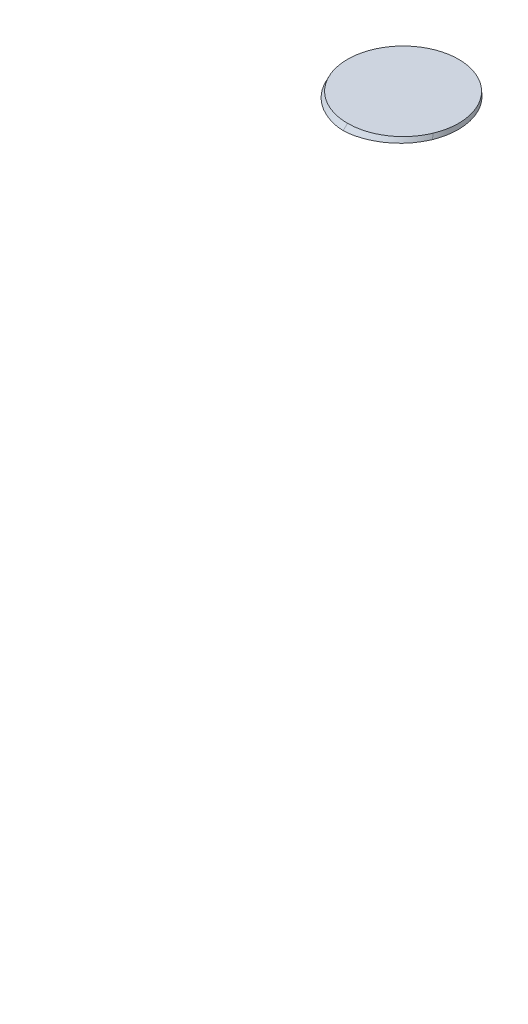
ISO-10303-21;
HEADER;
FILE_DESCRIPTION(('STEP AP214'),'2;1');
FILE_NAME('part.step','',(''),(''),'','','');
FILE_SCHEMA(('AUTOMOTIVE_DESIGN { 1 0 10303 214 1 1 1 1 }'));
ENDSEC;
DATA;
#1=APPLICATION_CONTEXT('core data for automotive mechanical design processes');
#2=APPLICATION_PROTOCOL_DEFINITION('international standard','automotive_design',2000,#1);
#3=PRODUCT_CONTEXT('',#1,'mechanical');
#4=PRODUCT('Part','Part','',(#3));
#5=PRODUCT_RELATED_PRODUCT_CATEGORY('part','',(#4));
#6=PRODUCT_DEFINITION_FORMATION('','',#4);
#7=PRODUCT_DEFINITION_CONTEXT('part definition',#1,'design');
#8=PRODUCT_DEFINITION('design','',#6,#7);
#9=PRODUCT_DEFINITION_SHAPE('','',#8);
#10=(LENGTH_UNIT() NAMED_UNIT(*) SI_UNIT(.MILLI.,.METRE.));
#11=(NAMED_UNIT(*) PLANE_ANGLE_UNIT() SI_UNIT($,.RADIAN.));
#12=(NAMED_UNIT(*) SI_UNIT($,.STERADIAN.) SOLID_ANGLE_UNIT());
#13=UNCERTAINTY_MEASURE_WITH_UNIT(LENGTH_MEASURE(1.E-05),#10,'distance_accuracy_value','');
#14=(GEOMETRIC_REPRESENTATION_CONTEXT(3) GLOBAL_UNCERTAINTY_ASSIGNED_CONTEXT((#13)) GLOBAL_UNIT_ASSIGNED_CONTEXT((#10,
#11,#12)) REPRESENTATION_CONTEXT('',''));
#15=CARTESIAN_POINT('',(0.,0.,0.));
#16=DIRECTION('',(0.,0.,1.));
#17=DIRECTION('',(1.,0.,0.));
#18=AXIS2_PLACEMENT_3D('',#15,#16,#17);
#19=CARTESIAN_POINT('',(0.,0.,37.8266622175129));
#20=CARTESIAN_POINT('',(0.,176.855656283399,16.5663637902874));
#21=CARTESIAN_POINT('',(0.,340.340668935007,-67.1145601095371));
#22=CARTESIAN_POINT('',(0.,461.01,-198.144465052552));
#23=CARTESIAN_POINT('',(16.2738372031163,0.,37.8339538467932));
#24=CARTESIAN_POINT('',(13.2830214298912,176.856067777989,16.5726593592351));
#25=CARTESIAN_POINT('',(9.72615474150384,340.341204936384,-67.1108402702335));
#26=CARTESIAN_POINT('',(4.26081652528172,461.01,-198.144465052552));
#27=CARTESIAN_POINT('',(48.6636929103227,0.,35.3809758118689));
#28=CARTESIAN_POINT('',(36.7186881567966,171.059242212549,0.164893382210145));
#29=CARTESIAN_POINT('',(24.7736834032705,332.090501701255,-81.8666581518978));
#30=CARTESIAN_POINT('',(12.8286786497444,461.01,-199.409945468399));
#31=CARTESIAN_POINT('',(95.786593648475,0.,23.4460334216123));
#32=CARTESIAN_POINT('',(72.0554768292909,165.2628281417,-24.0055233113302));
#33=CARTESIAN_POINT('',(48.3243600101067,323.840334467504,-102.667392780572));
#34=CARTESIAN_POINT('',(24.5932431909225,461.01,-205.003752771409));
#35=CARTESIAN_POINT('',(140.462615411223,0.,3.62505389254308));
#36=CARTESIAN_POINT('',(105.026484701463,159.46641407085,-54.4808815285309));
#37=CARTESIAN_POINT('',(69.5903539917018,315.590167233752,-128.191973317755));
#38=CARTESIAN_POINT('',(34.154223281941,461.01,-213.740310367776));
#39=CARTESIAN_POINT('',(167.938090833647,0.,-14.7174822626746));
#40=CARTESIAN_POINT('',(124.794467512548,155.602138023617,-78.7145845088735));
#41=CARTESIAN_POINT('',(81.6508441914497,310.090055744584,-147.913405544456));
#42=CARTESIAN_POINT('',(38.5072208703511,461.01,-221.057975000304));
#43=CARTESIAN_POINT('',(180.915270900199,0.,-25.1417994304734));
#44=CARTESIAN_POINT('',(133.979344147636,153.67,-91.7305614942916));
#45=CARTESIAN_POINT('',(87.0434173950731,307.34,-158.31932355811));
#46=CARTESIAN_POINT('',(40.1074906425099,461.01,-224.908085621928));
#47=B_SPLINE_SURFACE_WITH_KNOTS('',3,3,((#19,#20,#21,#22),(#23,#24,#25,#26),(#27,#28,#29,#30),
(#31,#32,#33,#34),(#35,#36,#37,#38),(#39,#40,#41,#42),(#43,#44,#45,#46)),.UNSPECIFIED.,.F.,.F.,
.F.,(4,1,1,1,4),(4,4),(0.,0.0454258486198599,0.0908516972397197,0.13627754585958,
0.181703394479439),(0.,1.),.UNSPECIFIED.);
#48=CARTESIAN_POINT('',(41.0772411952488,457.835,-223.532284752841));
#49=CARTESIAN_POINT('',(40.8243911024281,457.835,-222.922113494448));
#50=CARTESIAN_POINT('',(40.5585174426541,457.835,-222.31734768942));
#51=CARTESIAN_POINT('',(40.0013810367137,457.835,-221.11966021395));
#52=CARTESIAN_POINT('',(39.7101195100156,457.835,-220.526737976299));
#53=CARTESIAN_POINT('',(39.1028481265413,457.835,-219.353725818955));
#54=CARTESIAN_POINT('',(38.7868388494163,457.835,-218.773635599113));
#55=CARTESIAN_POINT('',(38.1306767928213,457.835,-217.627287056805));
#56=CARTESIAN_POINT('',(37.7905244154437,457.835,-217.06102850419));
#57=CARTESIAN_POINT('',(37.0884207633574,457.835,-215.946155059123));
#58=CARTESIAN_POINT('',(36.7265874122214,457.835,-215.397465902851));
#59=CARTESIAN_POINT('',(35.9801709110653,457.835,-214.315801302327));
#60=CARTESIAN_POINT('',(35.5955882296785,457.835,-213.782825534719));
#61=CARTESIAN_POINT('',(34.8041986364917,457.835,-212.733638246663));
#62=CARTESIAN_POINT('',(34.397391961663,457.835,-212.217426547555));
#63=CARTESIAN_POINT('',(33.5622484868052,457.835,-211.202731155373));
#64=CARTESIAN_POINT('',(33.1339113375796,457.835,-210.704247750053));
#65=CARTESIAN_POINT('',(32.1109721819335,457.835,-209.563258119222));
#66=CARTESIAN_POINT('',(31.5083849363508,457.835,-208.927883778328));
#67=CARTESIAN_POINT('',(30.2687065956873,457.835,-207.691736739446));
#68=CARTESIAN_POINT('',(29.6316143879102,457.835,-207.090965158597));
#69=CARTESIAN_POINT('',(28.3248998786488,457.835,-205.925902368785));
#70=CARTESIAN_POINT('',(27.655277730108,457.835,-205.361610988335));
#71=CARTESIAN_POINT('',(26.2835337837226,457.835,-204.269937125595));
#72=CARTESIAN_POINT('',(25.5813267939306,457.835,-203.742661636202));
#73=CARTESIAN_POINT('',(24.1481306072547,457.835,-202.728883355318));
#74=CARTESIAN_POINT('',(23.4171426399354,457.835,-202.242378824806));
#75=CARTESIAN_POINT('',(21.9293172711326,457.835,-201.310886839312));
#76=CARTESIAN_POINT('',(21.172483523385,457.835,-200.865893548937));
#77=CARTESIAN_POINT('',(19.8251840800042,457.835,-200.122500998338));
#78=CARTESIAN_POINT('',(19.2397091606116,457.835,-199.815009884807));
#79=CARTESIAN_POINT('',(18.0566982548129,457.835,-199.224090816232));
#80=CARTESIAN_POINT('',(17.4591617806366,457.835,-198.940663836767));
#81=CARTESIAN_POINT('',(16.253001565373,457.835,-198.398033777319));
#82=CARTESIAN_POINT('',(15.6443748700352,457.835,-198.138837268073));
#83=CARTESIAN_POINT('',(14.4169656652541,457.835,-197.644882429115));
#84=CARTESIAN_POINT('',(13.7981786383782,457.835,-197.410135330361));
#85=CARTESIAN_POINT('',(12.5542268915855,457.835,-196.966169365047));
#86=CARTESIAN_POINT('',(11.9290964429561,457.835,-196.756854537368));
#87=CARTESIAN_POINT('',(10.6707350906673,457.835,-196.364527889343));
#88=CARTESIAN_POINT('',(10.0375057666726,457.835,-196.181511022346));
#89=CARTESIAN_POINT('',(8.7638520981027,457.835,-195.844148621362));
#90=CARTESIAN_POINT('',(8.12343244197169,457.835,-195.689785438119));
#91=CARTESIAN_POINT('',(6.83620700331565,457.835,-195.412215867836));
#92=CARTESIAN_POINT('',(6.18940537223215,457.835,-195.288990456544));
#93=CARTESIAN_POINT('',(5.23479023622483,457.835,-195.132754808584));
#94=CARTESIAN_POINT('',(4.92909448554644,457.835,-195.086555610956));
#95=CARTESIAN_POINT('',(4.31665930396211,457.835,-195.001920548));
#96=CARTESIAN_POINT('',(4.0099200054725,457.835,-194.963483732507));
#97=CARTESIAN_POINT('',(3.39557247943344,457.835,-194.894666769313));
#98=CARTESIAN_POINT('',(3.0879643510748,457.835,-194.864285736728));
#99=CARTESIAN_POINT('',(2.47190876538906,457.835,-194.811851629702));
#100=CARTESIAN_POINT('',(2.16346101437874,457.835,-194.789801992883));
#101=CARTESIAN_POINT('',(1.54602837631372,457.835,-194.754323594595));
#102=CARTESIAN_POINT('',(1.237043427038,457.835,-194.740895909178));
#103=CARTESIAN_POINT('',(0.618708230361594,457.835,-194.722912389835));
#104=CARTESIAN_POINT('',(0.309357892887292,457.835,-194.718359666874));
#105=CARTESIAN_POINT('',(0.,457.835,-194.718372568102));
#106=B_SPLINE_CURVE_WITH_KNOTS('',3,(#48,#49,#50,#51,#52,#53,#54,#55,#56,#57,#58,#59,#60,#61,
#62,#63,#64,#65,#66,#67,#68,#69,#70,#71,#72,#73,#74,#75,#76,#77,#78,#79,#80,#81,#82,#83,#84,#85,
#86,#87,#88,#89,#90,#91,#92,#93,#94,#95,#96,#97,#98,#99,#100,#101,#102,#103,#104,#105),
.UNSPECIFIED.,.F.,.F.,(4,2,2,2,2,2,2,2,2,2,2,2,2,2,2,2,2,2,2,2,2,2,2,2,2,2,2,2,4),(0.,
1.98129706633792,3.96249901642415,5.9436545759057,7.92477714787358,9.89596068161459,
11.8671036233571,13.8382255511813,15.8093794583785,18.4349841472042,21.060673555498,
23.6863506199811,26.3193287118544,28.9521944409109,31.5846894984493,33.5681016598502,
35.551594191923,37.5356230499041,39.5205592986916,41.4977566819198,43.4745741273323,
45.4501698807338,47.4245556694453,48.3519768047285,49.2792843490371,50.2064899914566,
51.1340777918723,52.0617813361567,52.9898100124919),.UNSPECIFIED.);
#107=CARTESIAN_POINT('',(41.0772411952488,457.835,-223.532284752841));
#108=VERTEX_POINT('',#107);
#109=CARTESIAN_POINT('',(0.,457.834999999999,-194.718372568101));
#110=VERTEX_POINT('',#109);
#111=EDGE_CURVE('E114',#108,#110,#106,.T.);
#112=DIRECTION('',(-0.269855854661785,0.883518278109037,-0.382848886575369));
#113=VECTOR('',#112,1.);
#114=CARTESIAN_POINT('',(110.511380771355,230.505,-125.024942526201));
#115=LINE('',#114,#113);
#116=CARTESIAN_POINT('',(40.1074906425099,461.01,-224.908085621928));
#117=VERTEX_POINT('',#116);
#118=EDGE_CURVE('E172',#108,#117,#115,.T.);
#119=CARTESIAN_POINT('',(0.,461.01,-198.144465052552));
#120=CARTESIAN_POINT('',(4.26081652528172,461.01,-198.144465052552));
#121=CARTESIAN_POINT('',(12.8286786497444,461.01,-199.409945468399));
#122=CARTESIAN_POINT('',(24.5932431909225,461.01,-205.003752771409));
#123=CARTESIAN_POINT('',(34.154223281941,461.01,-213.740310367776));
#124=CARTESIAN_POINT('',(38.5072208703511,461.01,-221.057975000304));
#125=CARTESIAN_POINT('',(40.1074906425099,461.01,-224.908085621928));
#126=B_SPLINE_CURVE_WITH_KNOTS('',3,(#119,#120,#121,#122,#123,#124,#125),.UNSPECIFIED.,.F.,.F.,
(4,1,1,1,4),(0.,0.0454258486198599,0.0908516972397197,0.13627754585958,0.181703394479439),.UNSPECIFIED.);
#127=CARTESIAN_POINT('',(0.,461.01,-198.144465052552));
#128=VERTEX_POINT('',#127);
#129=EDGE_CURVE('E132',#128,#117,#126,.T.);
#130=CARTESIAN_POINT('',(0.,0.,37.8266622175129));
#131=CARTESIAN_POINT('',(0.,176.855656283399,16.5663637902874));
#132=CARTESIAN_POINT('',(0.,340.340668935007,-67.1145601095371));
#133=CARTESIAN_POINT('',(0.,461.01,-198.144465052552));
#134=B_SPLINE_CURVE_WITH_KNOTS('',3,(#130,#131,#132,#133),.UNSPECIFIED.,.F.,.F.,(4,4),(0.,1.),.UNSPECIFIED.);
#135=EDGE_CURVE('E121',#110,#128,#134,.T.);
#136=ORIENTED_EDGE('',*,*,#111,.F.);
#137=ORIENTED_EDGE('',*,*,#118,.T.);
#138=ORIENTED_EDGE('',*,*,#129,.F.);
#139=ORIENTED_EDGE('',*,*,#135,.F.);
#140=EDGE_LOOP('',(#136,#137,#138,#139));
#141=FACE_BOUND('',#140,.T.);
#142=ADVANCED_FACE('F80',(#141),#47,.T.);
#143=CARTESIAN_POINT('',(24.2259791158959,461.01,-205.527544486969));
#144=DIRECTION('',(0.,-1.,3.07059717205403E-13));
#145=DIRECTION('',(0.,-3.07059717205403E-13,-1.));
#146=AXIS2_PLACEMENT_3D('',#143,#144,#145);
#147=PLANE('',#146);
#148=ORIENTED_EDGE('',*,*,#129,.T.);
#149=CARTESIAN_POINT('',(40.1074906425099,461.01,-224.908085621928));
#150=CARTESIAN_POINT('',(41.8780040229971,461.01,-229.167787636261));
#151=CARTESIAN_POINT('',(44.0257828378412,461.009999999999,-238.188253767412));
#152=CARTESIAN_POINT('',(43.1036005743337,461.01,-249.612051547517));
#153=CARTESIAN_POINT('',(40.3137245671403,461.01,-258.204593498601));
#154=CARTESIAN_POINT('',(37.2632392750082,461.01,-264.23349338102));
#155=CARTESIAN_POINT('',(33.3226625075956,461.01,-269.70462823815));
#156=CARTESIAN_POINT('',(30.1712134255373,461.01,-272.902871411489));
#157=CARTESIAN_POINT('',(26.5089975315132,461.01,-276.083715254617));
#158=CARTESIAN_POINT('',(22.2673703077516,461.01,-279.140719558671));
#159=CARTESIAN_POINT('',(15.226146532433,461.010000000001,-282.505207352624));
#160=CARTESIAN_POINT('',(7.72365131381288,461.010000000001,-284.551933601713));
#161=CARTESIAN_POINT('',(-0.00935791936474599,461.01,-285.245026817753));
#162=CARTESIAN_POINT('',(-7.74212373835592,461.009999999999,-284.548615512557));
#163=CARTESIAN_POINT('',(-15.2438856512909,461.009999999999,-282.498616777706));
#164=CARTESIAN_POINT('',(-22.2838831662997,461.010000000001,-279.130947704782));
#165=CARTESIAN_POINT('',(-26.5243591779975,461.01,-276.07191894679));
#166=CARTESIAN_POINT('',(-30.1849426382904,461.01,-272.889612095302));
#167=CARTESIAN_POINT('',(-33.3343956896679,461.01,-269.690623293021));
#168=CARTESIAN_POINT('',(-37.2719856644906,461.01,-264.218963591208));
#169=CARTESIAN_POINT('',(-40.319653447414,461.01,-258.190055958844));
#170=CARTESIAN_POINT('',(-43.1060790369736,461.010000000001,-249.597995096214));
#171=CARTESIAN_POINT('',(-44.0246735499032,461.01,-238.175348771264));
#172=CARTESIAN_POINT('',(-41.8744261743165,461.01,-229.155605423159));
#173=CARTESIAN_POINT('',(-40.1025247862652,461.01,-224.896143218737));
#174=B_SPLINE_CURVE_WITH_KNOTS('',3,(#149,#150,#151,#152,#153,#154,#155,#156,#157,#158,#159,
#160,#161,#162,#163,#164,#165,#166,#167,#168,#169,#170,#171,#172,#173),.UNSPECIFIED.,.F.,.F.,(4,
1,1,1,1,1,2,1,1,1,1,1,1,1,2,1,1,1,1,1,4),(0.181703394479439,0.231961841016329,0.28222028755322,
0.307349510821665,0.33247873409011,0.357607957358555,0.382737180627,0.412076474912433,
0.441415769197866,0.470755063483299,0.500094357768732,0.529433652054165,0.558772946339598,
0.588112240625031,0.617451534910464,0.64257470662401,0.667697878337558,0.692821050051105,
0.717944221764651,0.768190565191745,0.818436908618839),.UNSPECIFIED.);
#175=CARTESIAN_POINT('',(-40.1025247862652,461.01,-224.896143218737));
#176=VERTEX_POINT('',#175);
#177=EDGE_CURVE('E142',#117,#176,#174,.T.);
#178=ORIENTED_EDGE('',*,*,#177,.T.);
#179=CARTESIAN_POINT('',(-40.1025247862652,461.01,-224.896143218737));
#180=CARTESIAN_POINT('',(-38.501851624576,461.01,-221.048295432272));
#181=CARTESIAN_POINT('',(-34.1483936162484,461.010000000002,-213.733340205379));
#182=CARTESIAN_POINT('',(-24.5860059797517,461.009999999998,-204.998900269145));
#183=CARTESIAN_POINT('',(-12.8215107168367,461.010000000001,-199.408083534367));
#184=CARTESIAN_POINT('',(-4.25752651654092,461.01,-198.144465052552));
#185=CARTESIAN_POINT('',(0.,461.01,-198.144465052552));
#186=B_SPLINE_CURVE_WITH_KNOTS('',3,(#179,#180,#181,#182,#183,#184,#185),.UNSPECIFIED.,.F.,.F.,
(4,1,1,1,4),(0.818436908618839,0.863827681464129,0.909218454309419,0.95460922715471,1.),.UNSPECIFIED.);
#187=EDGE_CURVE('E136',#176,#128,#186,.T.);
#188=ORIENTED_EDGE('',*,*,#187,.T.);
#189=EDGE_LOOP('',(#148,#178,#188));
#190=FACE_BOUND('',#189,.T.);
#191=ADVANCED_FACE('F184',(#190),#147,.F.);
#192=CARTESIAN_POINT('',(180.915270900199,0.,-25.1417994304734));
#193=CARTESIAN_POINT('',(133.979344147636,153.67,-91.7305614942916));
#194=CARTESIAN_POINT('',(87.0434173950731,307.34,-158.31932355811));
#195=CARTESIAN_POINT('',(40.1074906425099,461.01,-224.908085621928));
#196=CARTESIAN_POINT('',(182.764553739575,0.,-43.4647692189015));
#197=CARTESIAN_POINT('',(135.802370500716,153.67,-105.365775358021));
#198=CARTESIAN_POINT('',(88.8401872618566,307.34,-167.266781497141));
#199=CARTESIAN_POINT('',(41.8780040229971,461.01,-229.167787636261));
#200=CARTESIAN_POINT('',(182.934496924639,0.,-80.7365231107889));
#201=CARTESIAN_POINT('',(136.63159222904,153.67,-133.220433329663));
#202=CARTESIAN_POINT('',(90.3286875334404,307.34,-185.704343548538));
#203=CARTESIAN_POINT('',(44.0257828378412,461.009999999999,-238.188253767412));
#204=CARTESIAN_POINT('',(173.96381650555,0.,-126.992697283195));
#205=CARTESIAN_POINT('',(130.343744528478,153.67,-167.865815371303));
#206=CARTESIAN_POINT('',(86.7236725514057,307.34,-208.73893345941));
#207=CARTESIAN_POINT('',(43.1036005743337,461.01,-249.612051547517));
#208=CARTESIAN_POINT('',(161.356610836638,0.,-162.59980260165));
#209=CARTESIAN_POINT('',(121.008982080139,153.67,-194.468066233967));
#210=CARTESIAN_POINT('',(80.6613533236397,307.34,-226.336329866284));
#211=CARTESIAN_POINT('',(40.3137245671403,461.01,-258.204593498601));
#212=CARTESIAN_POINT('',(149.273172474338,0.,-188.312832378142));
#213=CARTESIAN_POINT('',(111.936528074562,153.67,-213.619719379101));
#214=CARTESIAN_POINT('',(74.5998836747849,307.34,-238.926606380061));
#215=CARTESIAN_POINT('',(37.2632392750082,461.01,-264.23349338102));
#216=CARTESIAN_POINT('',(134.665617032687,0.,-212.746278129332));
#217=CARTESIAN_POINT('',(100.88463219099,153.67,-231.732394832271));
#218=CARTESIAN_POINT('',(67.1036473492929,307.34,-250.718511535211));
#219=CARTESIAN_POINT('',(33.3226625075956,461.01,-269.70462823815));
#220=CARTESIAN_POINT('',(123.345757549626,0.,-228.001884615461));
#221=CARTESIAN_POINT('',(92.2875761749298,153.67,-242.968880214137));
#222=CARTESIAN_POINT('',(61.2293948002336,307.34,-257.935875812813));
#223=CARTESIAN_POINT('',(30.1712134255373,461.01,-272.902871411489));
#224=CARTESIAN_POINT('',(110.285132670713,0.,-243.884645412716));
#225=CARTESIAN_POINT('',(82.35975429098,153.67,-254.617668693349));
#226=CARTESIAN_POINT('',(54.4343759112466,307.34,-265.350691973983));
#227=CARTESIAN_POINT('',(26.5089975315132,461.01,-276.083715254617));
#228=CARTESIAN_POINT('',(94.2901878195833,0.,-259.504922954705));
#229=CARTESIAN_POINT('',(70.2825819823061,153.67,-266.050188489361));
#230=CARTESIAN_POINT('',(46.2749761450288,307.34,-272.595454024016));
#231=CARTESIAN_POINT('',(22.2673703077516,461.01,-279.140719558671));
#232=CARTESIAN_POINT('',(65.6190593842151,0.,-277.217367261442));
#233=CARTESIAN_POINT('',(48.8214217669544,153.67,-278.979980625169));
#234=CARTESIAN_POINT('',(32.0237841496937,307.34,-280.742593988896));
#235=CARTESIAN_POINT('',(15.226146532433,461.010000000001,-282.505207352624));
#236=CARTESIAN_POINT('',(33.6582002100138,0.,-288.25067540757));
#237=CARTESIAN_POINT('',(25.0133505779468,153.67,-287.017761472284));
#238=CARTESIAN_POINT('',(16.3685009458798,307.34,-285.784847536999));
#239=CARTESIAN_POINT('',(7.72365131381288,461.010000000001,-284.551933601713));
#240=CARTESIAN_POINT('',(-0.00184134112815246,0.,-291.997247453724));
#241=CARTESIAN_POINT('',(-0.00434686720701697,153.67,-289.746507241733));
#242=CARTESIAN_POINT('',(-0.00685239328588148,307.34,-287.495767029743));
#243=CARTESIAN_POINT('',(-0.00935791936474599,461.01,-285.245026817753));
#244=CARTESIAN_POINT('',(-33.661560363298,0.,-288.249883409989));
#245=CARTESIAN_POINT('',(-25.021748154984,153.67,-287.016127444178));
#246=CARTESIAN_POINT('',(-16.38193594667,307.34,-285.782371478367));
#247=CARTESIAN_POINT('',(-7.74212373835592,461.009999999999,-284.548615512557));
#248=CARTESIAN_POINT('',(-65.6215281171774,0.,-277.21612197542));
#249=CARTESIAN_POINT('',(-48.8289806285485,153.67,-278.976953576182));
#250=CARTESIAN_POINT('',(-32.0364331399197,307.34,-280.737785176944));
#251=CARTESIAN_POINT('',(-15.2438856512909,461.009999999999,-282.498616777706));
#252=CARTESIAN_POINT('',(-94.2914111238595,0.,-259.50384071545));
#253=CARTESIAN_POINT('',(-70.2889018046729,153.67,-266.046209711894));
#254=CARTESIAN_POINT('',(-46.2863924854863,307.34,-272.588578708338));
#255=CARTESIAN_POINT('',(-22.2838831662997,461.010000000001,-279.130947704782));
#256=CARTESIAN_POINT('',(-110.28550304737,0.,-243.884195005181));
#257=CARTESIAN_POINT('',(-82.3651217575793,153.67,-254.613436319051));
#258=CARTESIAN_POINT('',(-54.4447404677884,307.34,-265.342677632921));
#259=CARTESIAN_POINT('',(-26.5243591779975,461.01,-276.07191894679));
#260=CARTESIAN_POINT('',(-123.33470484305,0.,-227.996409980801));
#261=CARTESIAN_POINT('',(-92.2847841081302,153.67,-242.960810685635));
#262=CARTESIAN_POINT('',(-61.2348633732103,307.34,-257.925211390468));
#263=CARTESIAN_POINT('',(-30.1849426382904,461.01,-272.889612095302));
#264=CARTESIAN_POINT('',(-134.632233967405,0.,-212.730996948545));
#265=CARTESIAN_POINT('',(-100.866287874826,153.67,-231.71753906337));
#266=CARTESIAN_POINT('',(-67.1003417822469,307.34,-250.704081178196));
#267=CARTESIAN_POINT('',(-33.3343956896679,461.01,-269.690623293021));
#268=CARTESIAN_POINT('',(-149.205784351188,0.,-188.286535505023));
#269=CARTESIAN_POINT('',(-111.894518122289,153.67,-213.597344867084));
#270=CARTESIAN_POINT('',(-74.5832518933899,307.34,-238.908154229146));
#271=CARTESIAN_POINT('',(-37.2719856644906,461.01,-264.218963591208));
#272=CARTESIAN_POINT('',(-161.25496146668,0.,-162.566493639137));
#273=CARTESIAN_POINT('',(-120.943192126925,153.67,-194.441014412372));
#274=CARTESIAN_POINT('',(-80.6314227871695,307.34,-226.315535185608));
#275=CARTESIAN_POINT('',(-40.319653447414,461.01,-258.190055958844));
#276=CARTESIAN_POINT('',(-173.816711507298,0.,-126.955742814532));
#277=CARTESIAN_POINT('',(-130.246500683857,153.67,-167.836493575093));
#278=CARTESIAN_POINT('',(-86.6762898604151,307.34,-208.717244335653));
#279=CARTESIAN_POINT('',(-43.1060790369736,461.010000000001,-249.597995096214));
#280=CARTESIAN_POINT('',(-182.732185635456,0.,-80.7063813531382));
#281=CARTESIAN_POINT('',(-136.496348273605,153.67,-133.19603715918));
#282=CARTESIAN_POINT('',(-90.2605109117542,307.34,-185.685692965222));
#283=CARTESIAN_POINT('',(-44.0246735499032,461.01,-238.175348771264));
#284=CARTESIAN_POINT('',(-182.523439654924,0.,-43.4527769931953));
#285=CARTESIAN_POINT('',(-135.640435161388,153.67,-105.353719803183));
#286=CARTESIAN_POINT('',(-88.7574306678525,307.34,-167.254662613171));
#287=CARTESIAN_POINT('',(-41.8744261743165,461.01,-229.155605423159));
#288=CARTESIAN_POINT('',(-180.657164206162,0.,-25.1417994304731));
#289=CARTESIAN_POINT('',(-133.805617732863,153.67,-91.7265806932278));
#290=CARTESIAN_POINT('',(-86.9540712595643,307.34,-158.311361955982));
#291=CARTESIAN_POINT('',(-40.1025247862652,461.01,-224.896143218737));
#292=B_SPLINE_SURFACE_WITH_KNOTS('',3,3,((#192,#193,#194,#195),(#196,#197,#198,#199),(#200,#201,
#202,#203),(#204,#205,#206,#207),(#208,#209,#210,#211),(#212,#213,#214,#215),(#216,#217,#218,
#219),(#220,#221,#222,#223),(#224,#225,#226,#227),(#228,#229,#230,#231),(#232,#233,#234,#235),
(#236,#237,#238,#239),(#240,#241,#242,#243),(#244,#245,#246,#247),(#248,#249,#250,#251),(#252,
#253,#254,#255),(#256,#257,#258,#259),(#260,#261,#262,#263),(#264,#265,#266,#267),(#268,#269,
#270,#271),(#272,#273,#274,#275),(#276,#277,#278,#279),(#280,#281,#282,#283),(#284,#285,#286,
#287),(#288,#289,#290,#291)),.UNSPECIFIED.,.F.,.F.,.F.,(4,1,1,1,1,1,2,1,1,1,1,1,1,1,2,1,1,1,1,1,
4),(4,4),(0.181703394479439,0.231961841016329,0.28222028755322,0.307349510821665,
0.33247873409011,0.357607957358555,0.382737180627,0.412076474912433,0.441415769197866,
0.470755063483299,0.500094357768732,0.529433652054165,0.558772946339598,0.588112240625031,
0.617451534910464,0.64257470662401,0.667697878337558,0.692821050051105,0.717944221764651,
0.768190565191745,0.818436908618839),(0.,1.),.UNSPECIFIED.);
#293=CARTESIAN_POINT('',(-41.0705319448044,457.835,-223.520424597606));
#294=CARTESIAN_POINT('',(-41.3869568209653,457.835,-224.298054513311));
#295=CARTESIAN_POINT('',(-41.6813215056797,457.835,-225.084641656854));
#296=CARTESIAN_POINT('',(-42.2252991450807,457.835,-226.673139473737));
#297=CARTESIAN_POINT('',(-42.4749123018203,457.835,-227.475050077872));
#298=CARTESIAN_POINT('',(-42.9287604961273,457.835,-229.091618400597));
#299=CARTESIAN_POINT('',(-43.1329951158884,457.835,-229.906276236478));
#300=CARTESIAN_POINT('',(-43.4953637172038,457.835,-231.545147808259));
#301=CARTESIAN_POINT('',(-43.6535310944138,457.835,-232.369354169162));
#302=CARTESIAN_POINT('',(-43.9233894406798,457.835,-234.025369539729));
#303=CARTESIAN_POINT('',(-44.0350815931203,457.835,-234.857178355263));
#304=CARTESIAN_POINT('',(-44.1673296206268,457.835,-236.108517851855));
#305=CARTESIAN_POINT('',(-44.2055312275506,457.835,-236.526248281619));
#306=CARTESIAN_POINT('',(-44.2701013696751,457.835,-237.3626294576));
#307=CARTESIAN_POINT('',(-44.2964694200596,457.835,-237.781280240818));
#308=CARTESIAN_POINT('',(-44.3782984681353,457.835,-239.457376364093));
#309=CARTESIAN_POINT('',(-44.3864425180835,457.835,-240.717472365408));
#310=CARTESIAN_POINT('',(-44.2968768645322,457.835,-243.233854095554));
#311=CARTESIAN_POINT('',(-44.1991648365549,457.835,-244.490139740106));
#312=CARTESIAN_POINT('',(-43.9739199425003,457.835,-246.364678954973));
#313=CARTESIAN_POINT('',(-43.8857267585446,457.835,-246.987871061983));
#314=CARTESIAN_POINT('',(-43.683210959297,457.835,-248.230034658936));
#315=CARTESIAN_POINT('',(-43.5688883226535,457.835,-248.849006145429));
#316=CARTESIAN_POINT('',(-43.3142116475906,457.835,-250.08158605959));
#317=CARTESIAN_POINT('',(-43.1738566754709,457.835,-250.695194294068));
#318=CARTESIAN_POINT('',(-42.8672895223502,457.835,-251.915916817399));
#319=CARTESIAN_POINT('',(-42.701077311523,457.835,-252.523031098761));
#320=CARTESIAN_POINT('',(-42.3430622798222,457.835,-253.730277442284));
#321=CARTESIAN_POINT('',(-42.151236295636,457.835,-254.330402643558));
#322=CARTESIAN_POINT('',(-41.7425419339537,457.835,-255.522017987745));
#323=CARTESIAN_POINT('',(-41.5256735899339,457.835,-256.1135081422));
#324=CARTESIAN_POINT('',(-40.8382190425921,457.835,-257.87322305878));
#325=CARTESIAN_POINT('',(-40.3306199700175,457.835,-259.027242512506));
#326=CARTESIAN_POINT('',(-39.2204293777965,457.835,-261.288317259455));
#327=CARTESIAN_POINT('',(-38.6178495196059,457.835,-262.395378296944));
#328=CARTESIAN_POINT('',(-37.3204424721845,457.835,-264.555583548292));
#329=CARTESIAN_POINT('',(-36.6255228195703,457.835,-265.60867223343));
#330=CARTESIAN_POINT('',(-35.1494693251089,457.835,-267.652752122967));
#331=CARTESIAN_POINT('',(-34.3683357838324,457.835,-268.643743543839));
#332=CARTESIAN_POINT('',(-33.1363962672107,457.835,-270.078444700828));
#333=CARTESIAN_POINT('',(-32.7155564936448,457.835,-270.548198384211));
#334=CARTESIAN_POINT('',(-31.8544653552421,457.835,-271.469617414368));
#335=CARTESIAN_POINT('',(-31.4142140157575,457.835,-271.921282784764));
#336=CARTESIAN_POINT('',(-30.5150735802839,457.835,-272.805600121618));
#337=CARTESIAN_POINT('',(-30.0561859987152,457.835,-273.238253627096));
#338=CARTESIAN_POINT('',(-29.354459118491,457.835,-273.872362273257));
#339=CARTESIAN_POINT('',(-29.1183126624103,457.835,-274.081257294324));
#340=CARTESIAN_POINT('',(-28.6415827248757,457.835,-274.493928582378));
#341=CARTESIAN_POINT('',(-28.4009989517756,457.835,-274.697704510815));
#342=CARTESIAN_POINT('',(-27.1879019060955,457.835,-275.703017579336));
#343=CARTESIAN_POINT('',(-26.1825445451156,457.835,-276.465883292798));
#344=CARTESIAN_POINT('',(-24.6307530087644,457.835,-277.542110991223));
#345=CARTESIAN_POINT('',(-24.1070812308819,457.835,-277.889000608958));
#346=CARTESIAN_POINT('',(-23.0454584682878,457.835,-278.560135180749));
#347=CARTESIAN_POINT('',(-22.5075098131543,457.835,-278.884383798197));
#348=CARTESIAN_POINT('',(-21.4187736509424,457.835,-279.5093672074));
#349=CARTESIAN_POINT('',(-20.8679978743645,457.835,-279.81012246639));
#350=CARTESIAN_POINT('',(-19.7541144777705,457.835,-280.387921611379));
#351=CARTESIAN_POINT('',(-19.191006338857,457.835,-280.664964497237));
#352=CARTESIAN_POINT('',(-18.053282184502,457.835,-281.194875105161));
#353=CARTESIAN_POINT('',(-17.4786623198646,457.835,-281.447734572111));
#354=CARTESIAN_POINT('',(-16.3191093567829,457.835,-281.928627428196));
#355=CARTESIAN_POINT('',(-15.7341753174656,457.835,-282.156658538699));
#356=CARTESIAN_POINT('',(-13.9653213442135,457.835,-282.802813026617));
#357=CARTESIAN_POINT('',(-12.7672926294747,457.835,-283.183024082074));
#358=CARTESIAN_POINT('',(-10.3587489494182,457.835,-283.835967795594));
#359=CARTESIAN_POINT('',(-9.14858305328987,457.835,-284.109997855509));
#360=CARTESIAN_POINT('',(-6.70961371038914,457.835,-284.555674356511));
#361=CARTESIAN_POINT('',(-5.48081143901409,457.835,-284.727327227223));
#362=CARTESIAN_POINT('',(-3.0129221610269,457.835,-284.966771192018));
#363=CARTESIAN_POINT('',(-1.77383487184123,457.835,-285.034559422933));
#364=CARTESIAN_POINT('',(0.0854557169827443,457.835,-285.057237826268));
#365=CARTESIAN_POINT('',(0.705398809805119,457.835,-285.051624904428));
#366=CARTESIAN_POINT('',(1.94449529625227,457.835,-285.014142974262));
#367=CARTESIAN_POINT('',(2.5636486859051,457.835,-284.982273834394));
#368=CARTESIAN_POINT('',(4.41865737860438,457.835,-284.84752511138));
#369=CARTESIAN_POINT('',(5.65187008504397,457.835,-284.705501992601));
#370=CARTESIAN_POINT('',(8.10206058453671,457.835,-284.318508318158));
#371=CARTESIAN_POINT('',(9.31903806834946,457.835,-284.073535804447));
#372=CARTESIAN_POINT('',(11.12556362184,457.835,-283.630232788556));
#373=CARTESIAN_POINT('',(11.7246334838912,457.835,-283.46980709733));
#374=CARTESIAN_POINT('',(12.9155234504416,457.835,-283.123865391267));
#375=CARTESIAN_POINT('',(13.5073435817632,457.835,-282.938349469289));
#376=CARTESIAN_POINT('',(14.6825913066033,457.835,-282.542463431851));
#377=CARTESIAN_POINT('',(15.2660190484002,457.835,-282.332093756119));
#378=CARTESIAN_POINT('',(16.4234278419087,457.835,-281.886791147619));
#379=CARTESIAN_POINT('',(16.9974088730256,457.835,-281.651858161309));
#380=CARTESIAN_POINT('',(18.1353992381999,457.835,-281.157771088855));
#381=CARTESIAN_POINT('',(18.6994001266027,457.835,-280.898597555276));
#382=CARTESIAN_POINT('',(19.8159746256212,457.835,-280.356705107961));
#383=CARTESIAN_POINT('',(20.3685482351474,457.835,-280.07398619198));
#384=CARTESIAN_POINT('',(21.4613044012646,457.835,-279.485528188382));
#385=CARTESIAN_POINT('',(22.0014868607232,457.835,-279.179788920391));
#386=CARTESIAN_POINT('',(23.0684903534492,457.835,-278.545820373925));
#387=CARTESIAN_POINT('',(23.5953113626527,457.835,-278.217591054949));
#388=CARTESIAN_POINT('',(24.6347058697693,457.835,-277.539227149666));
#389=CARTESIAN_POINT('',(25.1472784197038,457.835,-277.189091110876));
#390=CARTESIAN_POINT('',(26.15722524601,457.835,-276.467552225922));
#391=CARTESIAN_POINT('',(26.6545996050995,457.835,-276.096149495538));
#392=CARTESIAN_POINT('',(27.6332505439754,457.835,-275.332703614287));
#393=CARTESIAN_POINT('',(28.1145271300148,457.835,-274.940660471439));
#394=CARTESIAN_POINT('',(29.0600620578904,457.835,-274.136568804617));
#395=CARTESIAN_POINT('',(29.5243203123058,457.835,-273.724520177903));
#396=CARTESIAN_POINT('',(30.4354380284813,457.835,-272.881361496536));
#397=CARTESIAN_POINT('',(30.8822928025651,457.835,-272.450246372139));
#398=CARTESIAN_POINT('',(31.7576895374614,457.835,-271.569887570575));
#399=CARTESIAN_POINT('',(32.1862315134694,457.835,-271.120643908453));
#400=CARTESIAN_POINT('',(33.4434445954202,457.835,-269.746819782953));
#401=CARTESIAN_POINT('',(34.2438878143583,457.835,-268.795974912746));
#402=CARTESIAN_POINT('',(35.3832421817698,457.835,-267.322882028894));
#403=CARTESIAN_POINT('',(35.7528543248375,457.835,-266.82397627879));
#404=CARTESIAN_POINT('',(36.4710947298093,457.835,-265.811215289875));
#405=CARTESIAN_POINT('',(36.8197230774775,457.835,-265.297360112178));
#406=CARTESIAN_POINT('',(37.4952483081195,457.835,-264.255579809684));
#407=CARTESIAN_POINT('',(37.8221453863721,457.835,-263.72765481138));
#408=CARTESIAN_POINT('',(38.4535964038899,457.835,-262.658604985938));
#409=CARTESIAN_POINT('',(38.7581502506828,457.835,-262.117480104181));
#410=CARTESIAN_POINT('',(39.3489694440695,457.835,-261.014720356462));
#411=CARTESIAN_POINT('',(39.6348866686281,457.835,-260.45289879377));
#412=CARTESIAN_POINT('',(40.1828231356309,457.835,-259.317765638404));
#413=CARTESIAN_POINT('',(40.4448422530124,457.835,-258.744453985621));
#414=CARTESIAN_POINT('',(41.1944184671358,457.835,-257.008767368332));
#415=CARTESIAN_POINT('',(41.6456111120755,457.835,-255.830422802899));
#416=CARTESIAN_POINT('',(42.4473383740423,457.835,-253.440027391977));
#417=CARTESIAN_POINT('',(42.7978627543639,457.835,-252.227973132367));
#418=CARTESIAN_POINT('',(43.3949495147253,457.835,-249.778386282094));
#419=CARTESIAN_POINT('',(43.6415142281176,457.835,-248.540854263928));
#420=CARTESIAN_POINT('',(43.9650491242646,457.835,-246.464471817578));
#421=CARTESIAN_POINT('',(44.0711522108949,457.835,-245.630029407978));
#422=CARTESIAN_POINT('',(44.2364343972971,457.835,-243.95642789223));
#423=CARTESIAN_POINT('',(44.2956119752133,457.835,-243.117268633998));
#424=CARTESIAN_POINT('',(44.3667805585958,457.835,-241.436916639155));
#425=CARTESIAN_POINT('',(44.3787688453722,457.835,-240.595723788178));
#426=CARTESIAN_POINT('',(44.3553429603122,457.835,-238.914442625625));
#427=CARTESIAN_POINT('',(44.3199545463901,457.835,-238.07435396222));
#428=CARTESIAN_POINT('',(44.2016263569406,457.835,-236.397613669084));
#429=CARTESIAN_POINT('',(44.1186905184003,457.835,-235.560961760561));
#430=CARTESIAN_POINT('',(43.9058443381054,457.835,-233.89386376261));
#431=CARTESIAN_POINT('',(43.7759474925503,457.835,-233.063415960091));
#432=CARTESIAN_POINT('',(43.5308115100364,457.835,-231.740549400807));
#433=CARTESIAN_POINT('',(43.4303690166327,457.835,-231.245338869902));
#434=CARTESIAN_POINT('',(43.2128538185096,457.835,-230.258673936923));
#435=CARTESIAN_POINT('',(43.0957844936935,457.835,-229.767218792799));
#436=CARTESIAN_POINT('',(42.8451438131823,457.835,-228.788593146886));
#437=CARTESIAN_POINT('',(42.7115741790986,457.835,-228.301422203764));
#438=CARTESIAN_POINT('',(42.4282858149814,457.835,-227.332665569886));
#439=CARTESIAN_POINT('',(42.2785939628434,457.835,-226.85107202141));
#440=CARTESIAN_POINT('',(41.9630004247947,457.835,-225.893172688221));
#441=CARTESIAN_POINT('',(41.7970971462881,457.835,-225.416867428153));
#442=CARTESIAN_POINT('',(41.4491986041891,457.835,-224.470057762611));
#443=CARTESIAN_POINT('',(41.2671999815656,457.835,-223.999554591465));
#444=CARTESIAN_POINT('',(41.0772411952488,457.835,-223.532284752841));
#445=B_SPLINE_CURVE_WITH_KNOTS('',3,(#293,#294,#295,#296,#297,#298,#299,#300,#301,#302,#303,
#304,#305,#306,#307,#308,#309,#310,#311,#312,#313,#314,#315,#316,#317,#318,#319,#320,#321,#322,
#323,#324,#325,#326,#327,#328,#329,#330,#331,#332,#333,#334,#335,#336,#337,#338,#339,#340,#341,
#342,#343,#344,#345,#346,#347,#348,#349,#350,#351,#352,#353,#354,#355,#356,#357,#358,#359,#360,
#361,#362,#363,#364,#365,#366,#367,#368,#369,#370,#371,#372,#373,#374,#375,#376,#377,#378,#379,
#380,#381,#382,#383,#384,#385,#386,#387,#388,#389,#390,#391,#392,#393,#394,#395,#396,#397,#398,
#399,#400,#401,#402,#403,#404,#405,#406,#407,#408,#409,#410,#411,#412,#413,#414,#415,#416,#417,
#418,#419,#420,#421,#422,#423,#424,#425,#426,#427,#428,#429,#430,#431,#432,#433,#434,#435,#436,
#437,#438,#439,#440,#441,#442,#443,#444),.UNSPECIFIED.,.F.,.F.,(4,2,2,2,2,2,2,2,2,2,2,2,2,2,2,2,
2,2,2,2,2,2,2,2,2,2,2,2,2,2,2,2,2,2,2,2,2,2,2,2,2,2,2,2,2,2,2,2,2,2,2,2,2,2,2,2,2,2,2,2,2,2,2,2,
2,2,2,2,2,2,2,2,2,2,2,4),(0.,2.51826704934908,5.03652272844529,7.55480159250773,
10.0712503036382,12.5876349352776,13.8459045433607,15.1042256975569,18.8796938868859,
22.6552449828429,24.5429833455183,26.4307232507604,28.3185308765613,30.2063406799463,
32.0958693978954,33.985395589976,37.7627314883228,41.539603977435,45.3202873019121,
49.1009574460694,50.9925797666793,52.8841996168491,54.7756660563994,55.7214375320468,
56.6672713923784,60.4475335712693,62.3315627237998,64.2152863241533,66.0973500993058,
67.9794932170299,69.8622765363451,71.745232503462,75.5109566595987,79.2290966423812,
82.9470030890803,86.665012022959,88.5244339473492,90.3838651874278,94.1032991984682,
97.8228039545658,99.682881032679,101.542951226843,103.40298851647,105.263029860635,
107.124576471729,108.986123260288,110.84768463626,112.709249364662,114.570937651691,
116.432615804462,118.294293234091,120.155980225567,122.018165247702,123.880348724595,
127.603961646368,129.46627107732,131.328572896189,133.190857977996,135.053150766834,
136.943735038961,138.834329204268,142.61477823222,146.395611548624,150.176360000509,
152.698649875299,155.221021547913,157.743538538373,160.26468463564,162.785622008956,
165.305835461203,166.821465160519,168.336787202341,169.851951271622,171.364627354335,
172.877452190673,174.390593495668),.UNSPECIFIED.);
#446=CARTESIAN_POINT('',(-41.0705319448044,457.835,-223.520424597606));
#447=VERTEX_POINT('',#446);
#448=EDGE_CURVE('E14',#447,#108,#445,.T.);
#449=DIRECTION('',(0.269408316210722,0.883641609902795,-0.382879438472349));
#450=VECTOR('',#449,1.);
#451=CARTESIAN_POINT('',(-110.379844496214,230.505,-125.018971324605));
#452=LINE('',#451,#450);
#453=EDGE_CURVE('E127',#447,#176,#452,.T.);
#454=ORIENTED_EDGE('',*,*,#448,.F.);
#455=ORIENTED_EDGE('',*,*,#453,.T.);
#456=ORIENTED_EDGE('',*,*,#177,.F.);
#457=ORIENTED_EDGE('',*,*,#118,.F.);
#458=EDGE_LOOP('',(#454,#455,#456,#457));
#459=FACE_BOUND('',#458,.T.);
#460=ADVANCED_FACE('F186',(#459),#292,.T.);
#461=CARTESIAN_POINT('',(-180.657164206162,0.,-25.1417994304731));
#462=CARTESIAN_POINT('',(-133.805617732863,153.67,-91.7265806932278));
#463=CARTESIAN_POINT('',(-86.9540712595643,307.34,-158.311361955982));
#464=CARTESIAN_POINT('',(-40.1025247862652,461.01,-224.896143218737));
#465=CARTESIAN_POINT('',(-167.693980425327,0.,-14.728921234005));
#466=CARTESIAN_POINT('',(-124.629937491743,155.602138023617,-78.7189839670831));
#467=CARTESIAN_POINT('',(-81.5658945581596,310.090055744584,-147.910765489544));
#468=CARTESIAN_POINT('',(-38.501851624576,461.01,-221.048295432272));
#469=CARTESIAN_POINT('',(-140.257369297237,0.,3.59054337814151));
#470=CARTESIAN_POINT('',(-104.887710736907,159.466414070851,-54.5015651506663));
#471=CARTESIAN_POINT('',(-69.5180521765779,315.590167233753,-128.198830047624));
#472=CARTESIAN_POINT('',(-34.1483936162484,461.010000000002,-213.733340205379));
#473=CARTESIAN_POINT('',(-95.6583033631842,0.,23.3956235244073));
#474=CARTESIAN_POINT('',(-71.9675375687067,165.262828141699,-24.0375124087121));
#475=CARTESIAN_POINT('',(-48.2767717742292,323.840334467502,-102.680961078131));
#476=CARTESIAN_POINT('',(-24.5860059797517,461.009999999998,-204.998900269145));
#477=CARTESIAN_POINT('',(-48.6127894802128,0.,35.3416628469409));
#478=CARTESIAN_POINT('',(-36.6823632257541,171.05924221255,0.139305383601913));
#479=CARTESIAN_POINT('',(-24.7519369712954,332.090501701256,-81.8785211841862));
#480=CARTESIAN_POINT('',(-12.8215107168367,461.010000000001,-199.408083534367));
#481=CARTESIAN_POINT('',(-16.26127166688,0.,37.8193762183264));
#482=CARTESIAN_POINT('',(-13.2777984095717,176.855244950613,16.560070696822));
#483=CARTESIAN_POINT('',(-9.72293471080021,340.340133111085,-67.1182787173162));
#484=CARTESIAN_POINT('',(-4.25752651654092,461.01,-198.144465052552));
#485=CARTESIAN_POINT('',(0.,0.,37.8266622175129));
#486=CARTESIAN_POINT('',(0.,176.855656283399,16.5663637902874));
#487=CARTESIAN_POINT('',(0.,340.340668935007,-67.1145601095371));
#488=CARTESIAN_POINT('',(0.,461.01,-198.144465052552));
#489=B_SPLINE_SURFACE_WITH_KNOTS('',3,3,((#461,#462,#463,#464),(#465,#466,#467,#468),(#469,#470,
#471,#472),(#473,#474,#475,#476),(#477,#478,#479,#480),(#481,#482,#483,#484),(#485,#486,#487,
#488)),.UNSPECIFIED.,.F.,.F.,.F.,(4,1,1,1,4),(4,4),(0.818436908618839,0.863827681464129,
0.909218454309419,0.95460922715471,1.),(0.,1.),.UNSPECIFIED.);
#490=CARTESIAN_POINT('',(0.,457.835,-194.718372568101));
#491=CARTESIAN_POINT('',(-0.464712055860721,457.835,-194.718362285627));
#492=CARTESIAN_POINT('',(-0.929383613047044,457.835,-194.728679698227));
#493=CARTESIAN_POINT('',(-1.85701783405399,457.835,-194.769033064947));
#494=CARTESIAN_POINT('',(-2.31998206903963,457.835,-194.799032646583));
#495=CARTESIAN_POINT('',(-3.24385936712746,457.835,-194.877783261474));
#496=CARTESIAN_POINT('',(-3.70477394513089,457.835,-194.926516707472));
#497=CARTESIAN_POINT('',(-4.62424270708998,457.835,-195.041731492239));
#498=CARTESIAN_POINT('',(-5.08279749291673,457.835,-195.108208050965));
#499=CARTESIAN_POINT('',(-5.99703346941586,457.835,-195.257898270255));
#500=CARTESIAN_POINT('',(-6.45271537467575,457.835,-195.341107584537));
#501=CARTESIAN_POINT('',(-7.36108447776569,457.835,-195.523332029663));
#502=CARTESIAN_POINT('',(-7.81377042175919,457.835,-195.622353390021));
#503=CARTESIAN_POINT('',(-8.71581680986063,457.835,-195.835293118605));
#504=CARTESIAN_POINT('',(-9.16517578794388,457.835,-195.949217683962));
#505=CARTESIAN_POINT('',(-10.0602179853905,457.835,-196.191096843703));
#506=CARTESIAN_POINT('',(-10.5059001777864,457.835,-196.319055224145));
#507=CARTESIAN_POINT('',(-11.6051301621065,457.835,-196.65244575164));
#508=CARTESIAN_POINT('',(-12.2563162136228,457.835,-196.865696468115));
#509=CARTESIAN_POINT('',(-13.5493679613639,457.835,-197.318766288865));
#510=CARTESIAN_POINT('',(-14.1912333838083,457.835,-197.558586171794));
#511=CARTESIAN_POINT('',(-15.4645308770894,457.835,-198.064573403959));
#512=CARTESIAN_POINT('',(-16.0959626082051,457.835,-198.330741609131));
#513=CARTESIAN_POINT('',(-17.3472027409694,457.835,-198.889194843897));
#514=CARTESIAN_POINT('',(-17.9670106436523,457.835,-199.181480991543));
#515=CARTESIAN_POINT('',(-19.1949697286415,457.835,-199.79251826552));
#516=CARTESIAN_POINT('',(-19.8030956031393,457.835,-200.111320283362));
#517=CARTESIAN_POINT('',(-21.0051237307383,457.835,-200.774608543191));
#518=CARTESIAN_POINT('',(-21.5990268801449,457.835,-201.119093161022));
#519=CARTESIAN_POINT('',(-22.7713059939364,457.835,-201.8334724112));
#520=CARTESIAN_POINT('',(-23.3496834695759,457.835,-202.203364557836));
#521=CARTESIAN_POINT('',(-24.2045567389399,457.835,-202.777009398689));
#522=CARTESIAN_POINT('',(-24.4873995792421,457.835,-202.971359205833));
#523=CARTESIAN_POINT('',(-25.0486975412826,457.835,-203.366297468));
#524=CARTESIAN_POINT('',(-25.3271525916832,457.835,-203.566886024296));
#525=CARTESIAN_POINT('',(-26.3334133534061,457.835,-204.308809876665));
#526=CARTESIAN_POINT('',(-27.0478193804321,457.835,-204.868508283252));
#527=CARTESIAN_POINT('',(-28.443022254551,457.835,-206.028404677025));
#528=CARTESIAN_POINT('',(-29.1238145863883,457.835,-206.62860807967));
#529=CARTESIAN_POINT('',(-30.449659633887,457.835,-207.867414407103));
#530=CARTESIAN_POINT('',(-31.0947084977474,457.835,-208.506021454957));
#531=CARTESIAN_POINT('',(-32.3457832675637,457.835,-209.818502471118));
#532=CARTESIAN_POINT('',(-32.9518699816505,457.835,-210.492318354579));
#533=CARTESIAN_POINT('',(-33.830694732016,457.835,-211.528519392477));
#534=CARTESIAN_POINT('',(-34.1185784280952,457.835,-211.878156639022));
#535=CARTESIAN_POINT('',(-34.6839794460871,457.835,-212.585714405797));
#536=CARTESIAN_POINT('',(-34.9614966601807,457.835,-212.943635012116));
#537=CARTESIAN_POINT('',(-35.7780237101633,457.835,-214.029056160961));
#538=CARTESIAN_POINT('',(-36.301281551999,457.835,-214.768537563267));
#539=CARTESIAN_POINT('',(-37.0821655604734,457.835,-215.942739936744));
#540=CARTESIAN_POINT('',(-37.3548854751198,457.835,-216.367538058279));
#541=CARTESIAN_POINT('',(-37.8864616071693,457.835,-217.225629373476));
#542=CARTESIAN_POINT('',(-38.1453206168875,457.835,-217.658920831925));
#543=CARTESIAN_POINT('',(-38.64892989313,457.835,-218.533560226584));
#544=CARTESIAN_POINT('',(-38.893681616053,457.835,-218.974907324934));
#545=CARTESIAN_POINT('',(-39.3686088621702,457.835,-219.864824343498));
#546=CARTESIAN_POINT('',(-39.5987983766764,457.835,-220.31338679492));
#547=CARTESIAN_POINT('',(-40.0446035261977,457.835,-221.217748524486));
#548=CARTESIAN_POINT('',(-40.2602178119928,457.835,-221.673548467791));
#549=CARTESIAN_POINT('',(-40.6765985039545,457.835,-222.591988719566));
#550=CARTESIAN_POINT('',(-40.877361965682,457.835,-223.054630362822));
#551=CARTESIAN_POINT('',(-41.0705319448044,457.835,-223.520424597606));
#552=B_SPLINE_CURVE_WITH_KNOTS('',3,(#490,#491,#492,#493,#494,#495,#496,#497,#498,#499,#500,
#501,#502,#503,#504,#505,#506,#507,#508,#509,#510,#511,#512,#513,#514,#515,#516,#517,#518,#519,
#520,#521,#522,#523,#524,#525,#526,#527,#528,#529,#530,#531,#532,#533,#534,#535,#536,#537,#538,
#539,#540,#541,#542,#543,#544,#545,#546,#547,#548,#549,#550,#551),.UNSPECIFIED.,.F.,.F.,(4,2,2,
2,2,2,2,2,2,2,2,2,2,2,2,2,2,2,2,2,2,2,2,2,2,2,2,2,2,2,4),(0.,1.39396224425176,2.7853556866041,
4.17544607332247,5.56516234322564,6.95451810369102,8.34442258900924,9.73490687998908,
11.1257672242249,13.1807585209571,15.2358100585648,17.290928377334,19.3461347133401,
21.4053808619919,23.4644968951697,25.5234117636912,26.5528734761856,27.5823519087046,
30.3032802363813,33.0245730716681,35.7461585918993,38.4633879019605,39.8219328157054,
41.1804918553982,43.8963471963347,45.4105588073488,46.9244642199289,48.4382130599741,
49.9504846866866,51.4628961122992,52.9756066009973),.UNSPECIFIED.);
#553=EDGE_CURVE('E97',#110,#447,#552,.T.);
#554=ORIENTED_EDGE('',*,*,#553,.F.);
#555=ORIENTED_EDGE('',*,*,#135,.T.);
#556=ORIENTED_EDGE('',*,*,#187,.F.);
#557=ORIENTED_EDGE('',*,*,#453,.F.);
#558=EDGE_LOOP('',(#554,#555,#556,#557));
#559=FACE_BOUND('',#558,.T.);
#560=ADVANCED_FACE('F124',(#559),#489,.T.);
#561=CARTESIAN_POINT('',(-182.732185635456,457.835,0.));
#562=DIRECTION('',(0.,1.,0.));
#563=DIRECTION('',(0.,0.,1.));
#564=AXIS2_PLACEMENT_3D('',#561,#562,#563);
#565=PLANE('',#564);
#566=ORIENTED_EDGE('',*,*,#111,.T.);
#567=ORIENTED_EDGE('',*,*,#553,.T.);
#568=ORIENTED_EDGE('',*,*,#448,.T.);
#569=EDGE_LOOP('',(#566,#567,#568));
#570=FACE_BOUND('',#569,.T.);
#571=ADVANCED_FACE('F116',(#570),#565,.F.);
#572=CLOSED_SHELL('',(#142,#191,#460,#560,#571));
#573=MANIFOLD_SOLID_BREP('B2',#572);
#574=CARTESIAN_POINT('',(0.,0.,37.8266622175129));
#575=CARTESIAN_POINT('',(0.,176.855656283399,16.5663637902874));
#576=CARTESIAN_POINT('',(0.,340.340668935007,-67.1145601095371));
#577=CARTESIAN_POINT('',(0.,461.01,-198.144465052552));
#578=CARTESIAN_POINT('',(16.2738372031163,0.,37.8339538467932));
#579=CARTESIAN_POINT('',(13.2830214298912,176.856067777989,16.5726593592351));
#580=CARTESIAN_POINT('',(9.72615474150384,340.341204936384,-67.1108402702335));
#581=CARTESIAN_POINT('',(4.26081652528172,461.01,-198.144465052552));
#582=CARTESIAN_POINT('',(48.6636929103227,0.,35.3809758118689));
#583=CARTESIAN_POINT('',(36.7186881567966,171.059242212549,0.164893382210145));
#584=CARTESIAN_POINT('',(24.7736834032705,332.090501701255,-81.8666581518978));
#585=CARTESIAN_POINT('',(12.8286786497444,461.01,-199.409945468399));
#586=CARTESIAN_POINT('',(95.786593648475,0.,23.4460334216123));
#587=CARTESIAN_POINT('',(72.0554768292909,165.2628281417,-24.0055233113302));
#588=CARTESIAN_POINT('',(48.3243600101067,323.840334467504,-102.667392780572));
#589=CARTESIAN_POINT('',(24.5932431909225,461.01,-205.003752771409));
#590=CARTESIAN_POINT('',(140.462615411223,0.,3.62505389254308));
#591=CARTESIAN_POINT('',(105.026484701463,159.46641407085,-54.4808815285309));
#592=CARTESIAN_POINT('',(69.5903539917018,315.590167233752,-128.191973317755));
#593=CARTESIAN_POINT('',(34.154223281941,461.01,-213.740310367776));
#594=CARTESIAN_POINT('',(167.938090833647,0.,-14.7174822626746));
#595=CARTESIAN_POINT('',(124.794467512548,155.602138023617,-78.7145845088735));
#596=CARTESIAN_POINT('',(81.6508441914497,310.090055744584,-147.913405544456));
#597=CARTESIAN_POINT('',(38.5072208703511,461.01,-221.057975000304));
#598=CARTESIAN_POINT('',(180.915270900199,0.,-25.1417994304734));
#599=CARTESIAN_POINT('',(133.979344147636,153.67,-91.7305614942916));
#600=CARTESIAN_POINT('',(87.0434173950731,307.34,-158.31932355811));
#601=CARTESIAN_POINT('',(40.1074906425099,461.01,-224.908085621928));
#602=B_SPLINE_SURFACE_WITH_KNOTS('',3,3,((#574,#575,#576,#577),(#578,#579,#580,#581),(#582,#583,
#584,#585),(#586,#587,#588,#589),(#590,#591,#592,#593),(#594,#595,#596,#597),(#598,#599,#600,
#601)),.UNSPECIFIED.,.F.,.F.,.F.,(4,1,1,1,4),(4,4),(0.,0.0454258486198599,0.0908516972397197,
0.13627754585958,0.181703394479439),(0.,1.),.UNSPECIFIED.);
#603=CARTESIAN_POINT('',(0.,0.,37.8266622175129));
#604=CARTESIAN_POINT('',(0.314816405135865,0.00118299085519161,37.8266622175129));
#605=CARTESIAN_POINT('',(0.629645722466348,-0.00149364796194215,37.8266622175129));
#606=CARTESIAN_POINT('',(1.25913942363553,-0.0145228326111447,37.8266622175129));
#607=CARTESIAN_POINT('',(1.57380381060857,-0.0248752268576537,37.8266622175129));
#608=CARTESIAN_POINT('',(2.20037992244844,-0.0531039766350987,37.8266622175129));
#609=CARTESIAN_POINT('',(2.51229426692313,-0.0709220813016826,37.8266622175129));
#610=CARTESIAN_POINT('',(3.1356058113812,-0.113964075563882,37.8266622175129));
#611=CARTESIAN_POINT('',(3.44700300993332,-0.139187985621702,37.8266622175129));
#612=CARTESIAN_POINT('',(4.37686306482555,-0.225450676645326,37.8266622175129));
#613=CARTESIAN_POINT('',(4.99435935412298,-0.297235121220687,37.8266622175129));
#614=CARTESIAN_POINT('',(6.2235484293311,-0.467648753194276,37.8266622175129));
#615=CARTESIAN_POINT('',(6.83525352389196,-0.566190398611963,37.8266622175129));
#616=CARTESIAN_POINT('',(8.05318387764383,-0.787976561210728,37.8266622175129));
#617=CARTESIAN_POINT('',(8.65941606875183,-0.911183192803998,37.8266622175129));
#618=CARTESIAN_POINT('',(9.8667038157874,-1.18005586251947,37.8266622175129));
#619=CARTESIAN_POINT('',(10.467760521361,-1.32571676941395,37.8266622175129));
#620=CARTESIAN_POINT('',(11.6584178276721,-1.63551946836768,37.8266622175129));
#621=CARTESIAN_POINT('',(12.2480726003189,-1.7994541182271,37.8266622175129));
#622=CARTESIAN_POINT('',(13.4229066123912,-2.14493333527499,37.8266622175129));
#623=CARTESIAN_POINT('',(14.008080004063,-2.32649770348123,37.8266622175129));
#624=CARTESIAN_POINT('',(15.1741900158922,-2.70517644425653,37.8266622175129));
#625=CARTESIAN_POINT('',(15.7551201924058,-2.90231058579285,37.8266622175129));
#626=CARTESIAN_POINT('',(16.9129409549178,-3.31018635622814,37.8266622175129));
#627=CARTESIAN_POINT('',(17.4898259421049,-3.52094382381325,37.8266622175129));
#628=CARTESIAN_POINT('',(18.6397106240699,-3.95426011710802,37.8266622175129));
#629=CARTESIAN_POINT('',(19.21270650322,-4.17682904762176,37.8266622175129));
#630=CARTESIAN_POINT('',(20.0692947176816,-4.51826550212078,37.8266622175129));
#631=CARTESIAN_POINT('',(20.3543970212637,-4.63336545860374,37.8266622175129));
#632=CARTESIAN_POINT('',(20.923646298739,-4.86590556661853,37.8266622175129));
#633=CARTESIAN_POINT('',(21.2077932716012,-4.98334572067494,37.8266622175129));
#634=CARTESIAN_POINT('',(22.0452194095185,-5.33321742355607,37.8266622175129));
#635=CARTESIAN_POINT('',(22.597225912061,-5.56869909128697,37.8266622175129));
#636=CARTESIAN_POINT('',(23.698135870355,-6.04681991784072,37.8266622175129));
#637=CARTESIAN_POINT('',(24.2470392613329,-6.28945922541802,37.8266622175129));
#638=CARTESIAN_POINT('',(25.3420999427998,-6.78095737435361,37.8266622175129));
#639=CARTESIAN_POINT('',(25.8882570293083,-7.02981666973572,37.8266622175129));
#640=CARTESIAN_POINT('',(26.9780800059684,-7.53293623763665,37.8266622175129));
#641=CARTESIAN_POINT('',(27.5217458724047,-7.78719656144147,37.8266622175129));
#642=CARTESIAN_POINT('',(29.1489333434445,-8.55680148453209,37.8266622175129));
#643=CARTESIAN_POINT('',(30.2291267614971,-9.07918784646561,37.8266622175129));
#644=CARTESIAN_POINT('',(32.3822385957333,-10.1385913941196,37.8266622175129));
#645=CARTESIAN_POINT('',(33.4551572688191,-10.6756080597854,37.8266622175129));
#646=CARTESIAN_POINT('',(35.5952232268693,-11.7618960873172,37.8266622175129));
#647=CARTESIAN_POINT('',(36.6623684372562,-12.3111715322509,37.8266622175129));
#648=CARTESIAN_POINT('',(38.7911223362554,-13.4203627771175,37.8266622175129));
#649=CARTESIAN_POINT('',(39.8527309757379,-13.9802786712662,37.8266622175129));
#650=CARTESIAN_POINT('',(41.9707867595274,-15.1103471355484,37.8266622175129));
#651=CARTESIAN_POINT('',(43.0272327090435,-15.6805019446324,37.8266622175129));
#652=CARTESIAN_POINT('',(45.1344913847262,-16.8311217645827,37.8266622175129));
#653=CARTESIAN_POINT('',(46.185304148554,-17.4115867064073,37.8266622175129));
#654=CARTESIAN_POINT('',(47.756914293507,-18.2905931352119,37.8266622175129));
#655=CARTESIAN_POINT('',(48.2800328311993,-18.5849896621519,37.8266622175129));
#656=CARTESIAN_POINT('',(49.3246110477547,-19.1767120109552,37.8266622175129));
#657=CARTESIAN_POINT('',(49.8460707276699,-19.4740378309602,37.8266622175129));
#658=CARTESIAN_POINT('',(50.8872834956997,-20.0716635475127,37.8266622175129));
#659=CARTESIAN_POINT('',(51.4070365822967,-20.3719634467042,37.8266622175129));
#660=CARTESIAN_POINT('',(52.4449036749938,-20.9753817421112,37.8266622175129));
#661=CARTESIAN_POINT('',(52.9630176798547,-21.278500140457,37.8266622175129));
#662=CARTESIAN_POINT('',(54.5148387546849,-22.1918408909814,37.8266622175129));
#663=CARTESIAN_POINT('',(55.5461581272024,-22.8061253531756,37.8266622175129));
#664=CARTESIAN_POINT('',(57.602792547454,-24.0446584930936,37.8266622175129));
#665=CARTESIAN_POINT('',(58.6281075820151,-24.6689071926668,37.8266622175129));
#666=CARTESIAN_POINT('',(60.6863300893658,-25.934750081628,37.8266622175129));
#667=CARTESIAN_POINT('',(61.719163778332,-26.5764642168045,37.8266622175129));
#668=CARTESIAN_POINT('',(63.7793657954362,-27.8685959132064,37.8266622175129));
#669=CARTESIAN_POINT('',(64.8067341293208,-28.5190134652781,37.8266622175128));
#670=CARTESIAN_POINT('',(67.8800052021959,-30.4815687107324,37.8266622175128));
#671=CARTESIAN_POINT('',(69.9182403696869,-31.8057283648273,37.8266622175128));
#672=CARTESIAN_POINT('',(73.9762009064059,-34.4807781396721,37.8266622175128));
#673=CARTESIAN_POINT('',(75.9959314705422,-35.8316603996335,37.8266622175128));
#674=CARTESIAN_POINT('',(80.0197910508825,-38.5559425315588,37.8266622175128));
#675=CARTESIAN_POINT('',(82.0239218409775,-39.9293397864432,37.8266622175128));
#676=CARTESIAN_POINT('',(86.0193211283024,-42.6946445363221,37.8266622175128));
#677=CARTESIAN_POINT('',(88.0105897601224,-44.0865518371591,37.8266622175128));
#678=CARTESIAN_POINT('',(91.9829209067401,-46.8850094384603,37.8266622175128));
#679=CARTESIAN_POINT('',(93.9639830063991,-48.2915603276153,37.8266622175128));
#680=CARTESIAN_POINT('',(95.9881227635598,-49.737008158941,37.8266622175128));
#681=CARTESIAN_POINT('',(96.0350531011189,-49.7705259198104,37.8266622175128));
#682=CARTESIAN_POINT('',(96.081981283958,-49.8040466876364,37.8266622175128));
#683=B_SPLINE_CURVE_WITH_KNOTS('',3,(#603,#604,#605,#606,#607,#608,#609,#610,#611,#612,#613,
#614,#615,#616,#617,#618,#619,#620,#621,#622,#623,#624,#625,#626,#627,#628,#629,#630,#631,#632,
#633,#634,#635,#636,#637,#638,#639,#640,#641,#642,#643,#644,#645,#646,#647,#648,#649,#650,#651,
#652,#653,#654,#655,#656,#657,#658,#659,#660,#661,#662,#663,#664,#665,#666,#667,#668,#669,#670,
#671,#672,#673,#674,#675,#676,#677,#678,#679,#680,#681,#682),.UNSPECIFIED.,.F.,.F.,(4,2,2,2,2,2,
2,2,2,2,2,2,2,2,2,2,2,2,2,2,2,2,2,2,2,2,2,2,2,2,2,2,2,2,2,2,2,2,2,4),(0.,0.944429634783637,
1.88884061888421,2.82601619932845,3.76319436920866,5.62745519213558,7.48568868129122,
9.34108951354213,11.1960669783346,13.0318228643042,14.8696649899247,16.709879345832,
18.5522730441575,20.3962691649691,21.3186390870013,22.2410100041336,24.0413523961527,
25.8417322303857,27.6422438681653,29.4427726105298,33.0422437064214,36.6415870205755,
40.2421476184304,43.8427401122845,47.4441297759657,51.0454953320735,52.8462932966475,
54.6470901189797,56.4478885423261,58.2486883268775,61.8498269130028,65.4509733967165,
69.0987847190824,72.7465922051997,80.0380965845213,87.3274870662503,94.6160361744303,
101.904508891002,109.193275753592,109.366287520837),.UNSPECIFIED.);
#684=CARTESIAN_POINT('',(0.,0.,37.8266622175129));
#685=VERTEX_POINT('',#684);
#686=CARTESIAN_POINT('',(0.287029214462541,5.31070556575484E-06,37.8266622175129));
#687=VERTEX_POINT('',#686);
#688=EDGE_CURVE('E262',#685,#687,#683,.T.);
#689=CARTESIAN_POINT('',(0.,0.,37.8266622175129));
#690=CARTESIAN_POINT('',(16.2738372031163,0.,37.8339538467932));
#691=CARTESIAN_POINT('',(48.6636929103227,0.,35.3809758118689));
#692=CARTESIAN_POINT('',(95.786593648475,0.,23.4460334216123));
#693=CARTESIAN_POINT('',(140.462615411223,0.,3.62505389254308));
#694=CARTESIAN_POINT('',(167.938090833647,0.,-14.7174822626746));
#695=CARTESIAN_POINT('',(180.915270900199,0.,-25.1417994304734));
#696=B_SPLINE_CURVE_WITH_KNOTS('',3,(#689,#690,#691,#692,#693,#694,#695),.UNSPECIFIED.,.F.,.F.,
(4,1,1,1,4),(0.,0.0454258486198599,0.0908516972397197,0.13627754585958,0.181703394479439),.UNSPECIFIED.);
#697=EDGE_CURVE('E78',#685,#687,#696,.T.);
#698=ORIENTED_EDGE('',*,*,#688,.F.);
#699=ORIENTED_EDGE('',*,*,#697,.T.);
#700=EDGE_LOOP('',(#698,#699));
#701=FACE_BOUND('',#700,.T.);
#702=ADVANCED_FACE('F245',(#701),#602,.T.);
#703=CARTESIAN_POINT('',(95.3787804859077,0.,22.1316938984768));
#704=DIRECTION('',(0.,-1.,0.));
#705=DIRECTION('',(0.,0.,-1.));
#706=AXIS2_PLACEMENT_3D('',#703,#704,#705);
#707=PLANE('',#706);
#708=DIRECTION('',(-1.,0.,0.));
#709=VECTOR('',#708,1.);
#710=CARTESIAN_POINT('',(95.3787804859077,0.,37.8266622175129));
#711=LINE('',#710,#709);
#712=EDGE_CURVE('E255',#687,#685,#711,.T.);
#713=ORIENTED_EDGE('',*,*,#712,.F.);
#714=ORIENTED_EDGE('',*,*,#697,.F.);
#715=EDGE_LOOP('',(#713,#714));
#716=FACE_BOUND('',#715,.T.);
#717=ADVANCED_FACE('F247',(#716),#707,.T.);
#718=CARTESIAN_POINT('',(-182.732185635456,0.,37.8266622175129));
#719=DIRECTION('',(0.,0.,1.));
#720=DIRECTION('',(0.,-1.,0.));
#721=AXIS2_PLACEMENT_3D('',#718,#719,#720);
#722=PLANE('',#721);
#723=ORIENTED_EDGE('',*,*,#712,.T.);
#724=ORIENTED_EDGE('',*,*,#688,.T.);
#725=EDGE_LOOP('',(#723,#724));
#726=FACE_BOUND('',#725,.T.);
#727=ADVANCED_FACE('F263',(#726),#722,.F.);
#728=CLOSED_SHELL('',(#702,#717,#727));
#729=MANIFOLD_SOLID_BREP('B8',#728);
#730=ADVANCED_BREP_SHAPE_REPRESENTATION('',(#18,#573,#729),#14);
#731=SHAPE_DEFINITION_REPRESENTATION(#9,#730);
ENDSEC;
END-ISO-10303-21;
